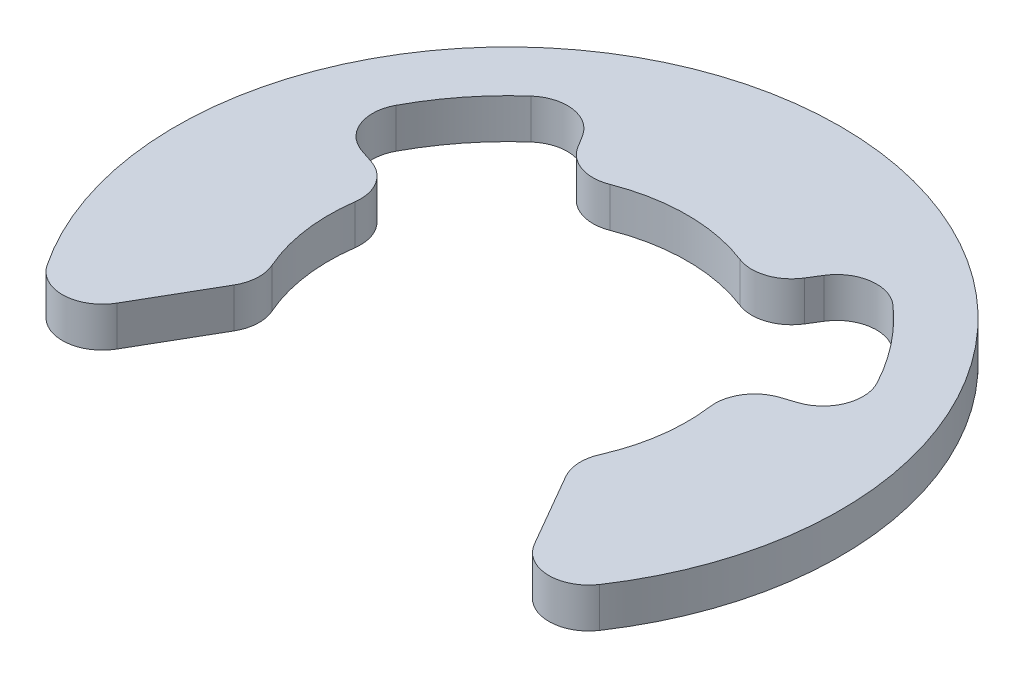
ISO-10303-21;
HEADER;
FILE_DESCRIPTION(('STEP AP214'),'2;1');
FILE_NAME('part.step','',(''),(''),'','','');
FILE_SCHEMA(('AUTOMOTIVE_DESIGN { 1 0 10303 214 1 1 1 1 }'));
ENDSEC;
DATA;
#1=APPLICATION_CONTEXT('core data for automotive mechanical design processes');
#2=APPLICATION_PROTOCOL_DEFINITION('international standard','automotive_design',2000,#1);
#3=PRODUCT_CONTEXT('',#1,'mechanical');
#4=PRODUCT('Part','Part','',(#3));
#5=PRODUCT_RELATED_PRODUCT_CATEGORY('part','',(#4));
#6=PRODUCT_DEFINITION_FORMATION('','',#4);
#7=PRODUCT_DEFINITION_CONTEXT('part definition',#1,'design');
#8=PRODUCT_DEFINITION('design','',#6,#7);
#9=PRODUCT_DEFINITION_SHAPE('','',#8);
#10=(LENGTH_UNIT() NAMED_UNIT(*) SI_UNIT(.MILLI.,.METRE.));
#11=(NAMED_UNIT(*) PLANE_ANGLE_UNIT() SI_UNIT($,.RADIAN.));
#12=(NAMED_UNIT(*) SI_UNIT($,.STERADIAN.) SOLID_ANGLE_UNIT());
#13=UNCERTAINTY_MEASURE_WITH_UNIT(LENGTH_MEASURE(1.E-05),#10,'distance_accuracy_value','');
#14=(GEOMETRIC_REPRESENTATION_CONTEXT(3) GLOBAL_UNCERTAINTY_ASSIGNED_CONTEXT((#13)) GLOBAL_UNIT_ASSIGNED_CONTEXT((#10,
#11,#12)) REPRESENTATION_CONTEXT('',''));
#15=CARTESIAN_POINT('',(0.,0.,0.));
#16=DIRECTION('',(0.,0.,1.));
#17=DIRECTION('',(1.,0.,0.));
#18=AXIS2_PLACEMENT_3D('',#15,#16,#17);
#19=CARTESIAN_POINT('',(0.,-0.5,0.));
#20=DIRECTION('',(0.,1.,0.));
#21=DIRECTION('',(0.,0.,1.));
#22=AXIS2_PLACEMENT_3D('',#19,#20,#21);
#23=PLANE('',#22);
#24=CARTESIAN_POINT('',(-5.03311248096179,-0.5,2.21760653723484));
#25=DIRECTION('',(0.,-1.,0.));
#26=DIRECTION('',(0.,0.,-1.));
#27=AXIS2_PLACEMENT_3D('',#24,#25,#26);
#28=CIRCLE('',#27,1.);
#29=CARTESIAN_POINT('',(-4.16708707717735,-0.5,2.71760653723484));
#30=VERTEX_POINT('',#29);
#31=CARTESIAN_POINT('',(-4.11800112078692,-0.5,1.81440534864669));
#32=VERTEX_POINT('',#31);
#33=EDGE_CURVE('E19',#30,#32,#28,.F.);
#34=ORIENTED_EDGE('',*,*,#33,.F.);
#35=DIRECTION('',(-0.500000000000001,0.,0.866025403784438));
#36=VECTOR('',#35,1.);
#37=CARTESIAN_POINT('',(-3.89711431702998,-0.5,2.24999999999999));
#38=LINE('',#37,#36);
#39=CARTESIAN_POINT('',(-5.2447671032849,-0.5,4.58420309675526));
#40=VERTEX_POINT('',#39);
#41=EDGE_CURVE('E171',#30,#40,#38,.T.);
#42=ORIENTED_EDGE('',*,*,#41,.T.);
#43=CARTESIAN_POINT('',(-6.11079250706933,-0.5,4.08420309675526));
#44=DIRECTION('',(0.,-1.,0.));
#45=DIRECTION('',(0.,0.,-1.));
#46=AXIS2_PLACEMENT_3D('',#43,#44,#45);
#47=CIRCLE('',#46,1.);
#48=CARTESIAN_POINT('',(-6.9421928481672,-0.5,4.63987698747026));
#49=VERTEX_POINT('',#48);
#50=EDGE_CURVE('E272',#49,#40,#47,.F.);
#51=ORIENTED_EDGE('',*,*,#50,.F.);
#52=CARTESIAN_POINT('',(0.,-0.5,0.));
#53=DIRECTION('',(0.,-1.,0.));
#54=DIRECTION('',(0.,0.,-1.));
#55=AXIS2_PLACEMENT_3D('',#52,#53,#54);
#56=CIRCLE('',#55,8.35);
#57=CARTESIAN_POINT('',(6.9421928481672,-0.5,4.63987698747026));
#58=VERTEX_POINT('',#57);
#59=EDGE_CURVE('E277',#58,#49,#56,.F.);
#60=ORIENTED_EDGE('',*,*,#59,.F.);
#61=CARTESIAN_POINT('',(6.11079250706933,-0.5,4.08420309675526));
#62=DIRECTION('',(0.,-1.,0.));
#63=DIRECTION('',(0.,0.,-1.));
#64=AXIS2_PLACEMENT_3D('',#61,#62,#63);
#65=CIRCLE('',#64,1.);
#66=CARTESIAN_POINT('',(5.2447671032849,-0.5,4.58420309675526));
#67=VERTEX_POINT('',#66);
#68=EDGE_CURVE('E280',#67,#58,#65,.F.);
#69=ORIENTED_EDGE('',*,*,#68,.F.);
#70=DIRECTION('',(-0.500000000000001,0.,-0.866025403784438));
#71=VECTOR('',#70,1.);
#72=CARTESIAN_POINT('',(3.89711431702998,-0.5,2.24999999999999));
#73=LINE('',#72,#71);
#74=CARTESIAN_POINT('',(4.16708707717735,-0.5,2.71760653723484));
#75=VERTEX_POINT('',#74);
#76=EDGE_CURVE('E201',#67,#75,#73,.T.);
#77=ORIENTED_EDGE('',*,*,#76,.T.);
#78=CARTESIAN_POINT('',(5.03311248096179,-0.5,2.21760653723484));
#79=DIRECTION('',(0.,-1.,0.));
#80=DIRECTION('',(0.,0.,-1.));
#81=AXIS2_PLACEMENT_3D('',#78,#79,#80);
#82=CIRCLE('',#81,1.);
#83=CARTESIAN_POINT('',(4.11800112078692,-0.5,1.81440534864669));
#84=VERTEX_POINT('',#83);
#85=EDGE_CURVE('E283',#84,#75,#82,.F.);
#86=ORIENTED_EDGE('',*,*,#85,.F.);
#87=CARTESIAN_POINT('',(0.,-0.5,0.));
#88=DIRECTION('',(0.,-1.,0.));
#89=DIRECTION('',(0.,0.,-1.));
#90=AXIS2_PLACEMENT_3D('',#87,#88,#89);
#91=CIRCLE('',#90,4.5);
#92=CARTESIAN_POINT('',(4.45860960941982,-0.5,-0.608933781941234));
#93=VERTEX_POINT('',#92);
#94=EDGE_CURVE('E286',#84,#93,#91,.F.);
#95=ORIENTED_EDGE('',*,*,#94,.T.);
#96=CARTESIAN_POINT('',(5.44941174484645,-0.5,-0.744252400150397));
#97=DIRECTION('',(0.,-1.,0.));
#98=DIRECTION('',(0.,0.,-1.));
#99=AXIS2_PLACEMENT_3D('',#96,#97,#98);
#100=CIRCLE('',#99,1.);
#101=CARTESIAN_POINT('',(5.13620275209304,-0.5,-1.69393662496325));
#102=VERTEX_POINT('',#101);
#103=EDGE_CURVE('E290',#102,#93,#100,.F.);
#104=ORIENTED_EDGE('',*,*,#103,.F.);
#105=DIRECTION('',(0.949684224812857,0.,-0.313208992753406));
#106=VECTOR('',#105,1.);
#107=CARTESIAN_POINT('',(4.27357901165786,-0.5,-1.40944046739033));
#108=LINE('',#107,#106);
#109=CARTESIAN_POINT('',(5.47388134366768,-0.5,-1.80530413932027));
#110=VERTEX_POINT('',#109);
#111=EDGE_CURVE('E206',#102,#110,#108,.T.);
#112=ORIENTED_EDGE('',*,*,#111,.T.);
#113=CARTESIAN_POINT('',(5.16067235091428,-0.5,-2.75498836413313));
#114=DIRECTION('',(0.,-1.,0.));
#115=DIRECTION('',(0.,0.,-1.));
#116=AXIS2_PLACEMENT_3D('',#113,#114,#115);
#117=CIRCLE('',#116,1.);
#118=CARTESIAN_POINT('',(6.04283856474577,-0.5,-3.22592654603623));
#119=VERTEX_POINT('',#118);
#120=EDGE_CURVE('E292',#110,#119,#117,.F.);
#121=ORIENTED_EDGE('',*,*,#120,.T.);
#122=CARTESIAN_POINT('',(0.,-0.5,0.));
#123=DIRECTION('',(0.,-1.,0.));
#124=DIRECTION('',(0.,0.,-1.));
#125=AXIS2_PLACEMENT_3D('',#122,#123,#124);
#126=CIRCLE('',#125,6.85);
#127=CARTESIAN_POINT('',(4.54697908095998,-0.5,-5.123229571014));
#128=VERTEX_POINT('',#127);
#129=EDGE_CURVE('E295',#119,#128,#126,.F.);
#130=ORIENTED_EDGE('',*,*,#129,.T.);
#131=CARTESIAN_POINT('',(3.88318651439648,-0.5,-4.37531284531853));
#132=DIRECTION('',(0.,-1.,0.));
#133=DIRECTION('',(0.,0.,-1.));
#134=AXIS2_PLACEMENT_3D('',#131,#132,#133);
#135=CIRCLE('',#134,1.);
#136=CARTESIAN_POINT('',(3.03280925313837,-0.5,-4.90148630866988));
#137=VERTEX_POINT('',#136);
#138=EDGE_CURVE('E299',#128,#137,#135,.F.);
#139=ORIENTED_EDGE('',*,*,#138,.T.);
#140=DIRECTION('',(-0.526173463351351,0.,0.85037726125811));
#141=VECTOR('',#140,1.);
#142=CARTESIAN_POINT('',(2.36778058508108,-0.5,-3.8266976756615));
#143=LINE('',#142,#141);
#144=CARTESIAN_POINT('',(2.84571810285265,-0.5,-4.59911822843213));
#145=VERTEX_POINT('',#144);
#146=EDGE_CURVE('E211',#137,#145,#143,.T.);
#147=ORIENTED_EDGE('',*,*,#146,.T.);
#148=CARTESIAN_POINT('',(1.99534084159454,-0.5,-5.12529169178348));
#149=DIRECTION('',(0.,-1.,0.));
#150=DIRECTION('',(0.,0.,-1.));
#151=AXIS2_PLACEMENT_3D('',#148,#149,#150);
#152=CIRCLE('',#151,1.);
#153=CARTESIAN_POINT('',(1.63255159766826,-0.5,-4.19342047509558));
#154=VERTEX_POINT('',#153);
#155=EDGE_CURVE('E301',#154,#145,#152,.F.);
#156=ORIENTED_EDGE('',*,*,#155,.F.);
#157=CARTESIAN_POINT('',(0.,-0.5,0.));
#158=DIRECTION('',(0.,-1.,0.));
#159=DIRECTION('',(0.,0.,-1.));
#160=AXIS2_PLACEMENT_3D('',#157,#158,#159);
#161=CIRCLE('',#160,4.5);
#162=CARTESIAN_POINT('',(-1.63255159766826,-0.5,-4.19342047509558));
#163=VERTEX_POINT('',#162);
#164=EDGE_CURVE('E304',#154,#163,#161,.F.);
#165=ORIENTED_EDGE('',*,*,#164,.T.);
#166=CARTESIAN_POINT('',(-1.99534084159454,-0.5,-5.12529169178348));
#167=DIRECTION('',(0.,-1.,0.));
#168=DIRECTION('',(0.,0.,-1.));
#169=AXIS2_PLACEMENT_3D('',#166,#167,#168);
#170=CIRCLE('',#169,1.);
#171=CARTESIAN_POINT('',(-2.84571810285265,-0.5,-4.59911822843213));
#172=VERTEX_POINT('',#171);
#173=EDGE_CURVE('E307',#172,#163,#170,.F.);
#174=ORIENTED_EDGE('',*,*,#173,.F.);
#175=DIRECTION('',(-0.526173463351351,0.,-0.85037726125811));
#176=VECTOR('',#175,1.);
#177=CARTESIAN_POINT('',(-2.36778058508108,-0.5,-3.8266976756615));
#178=LINE('',#177,#176);
#179=CARTESIAN_POINT('',(-3.03280925313837,-0.5,-4.90148630866988));
#180=VERTEX_POINT('',#179);
#181=EDGE_CURVE('E216',#172,#180,#178,.T.);
#182=ORIENTED_EDGE('',*,*,#181,.T.);
#183=CARTESIAN_POINT('',(-3.88318651439648,-0.5,-4.37531284531853));
#184=DIRECTION('',(0.,-1.,0.));
#185=DIRECTION('',(0.,0.,-1.));
#186=AXIS2_PLACEMENT_3D('',#183,#184,#185);
#187=CIRCLE('',#186,1.);
#188=CARTESIAN_POINT('',(-4.54697908095998,-0.5,-5.123229571014));
#189=VERTEX_POINT('',#188);
#190=EDGE_CURVE('E310',#180,#189,#187,.F.);
#191=ORIENTED_EDGE('',*,*,#190,.T.);
#192=CARTESIAN_POINT('',(0.,-0.5,0.));
#193=DIRECTION('',(0.,-1.,0.));
#194=DIRECTION('',(0.,0.,-1.));
#195=AXIS2_PLACEMENT_3D('',#192,#193,#194);
#196=CIRCLE('',#195,6.85);
#197=CARTESIAN_POINT('',(-6.04283856474578,-0.5,-3.22592654603623));
#198=VERTEX_POINT('',#197);
#199=EDGE_CURVE('E313',#189,#198,#196,.F.);
#200=ORIENTED_EDGE('',*,*,#199,.T.);
#201=CARTESIAN_POINT('',(-5.16067235091428,-0.5,-2.75498836413313));
#202=DIRECTION('',(0.,-1.,0.));
#203=DIRECTION('',(0.,0.,-1.));
#204=AXIS2_PLACEMENT_3D('',#201,#202,#203);
#205=CIRCLE('',#204,1.);
#206=CARTESIAN_POINT('',(-5.47388134366768,-0.5,-1.80530413932027));
#207=VERTEX_POINT('',#206);
#208=EDGE_CURVE('E317',#198,#207,#205,.F.);
#209=ORIENTED_EDGE('',*,*,#208,.T.);
#210=DIRECTION('',(0.949684224812857,0.,0.313208992753406));
#211=VECTOR('',#210,1.);
#212=CARTESIAN_POINT('',(-4.27357901165786,-0.5,-1.40944046739033));
#213=LINE('',#212,#211);
#214=CARTESIAN_POINT('',(-5.13620275209304,-0.5,-1.69393662496325));
#215=VERTEX_POINT('',#214);
#216=EDGE_CURVE('E221',#207,#215,#213,.T.);
#217=ORIENTED_EDGE('',*,*,#216,.T.);
#218=CARTESIAN_POINT('',(-5.44941174484645,-0.5,-0.744252400150397));
#219=DIRECTION('',(0.,-1.,0.));
#220=DIRECTION('',(0.,0.,-1.));
#221=AXIS2_PLACEMENT_3D('',#218,#219,#220);
#222=CIRCLE('',#221,1.);
#223=CARTESIAN_POINT('',(-4.45860960941982,-0.5,-0.608933781941234));
#224=VERTEX_POINT('',#223);
#225=EDGE_CURVE('E180',#224,#215,#222,.F.);
#226=ORIENTED_EDGE('',*,*,#225,.F.);
#227=CARTESIAN_POINT('',(0.,-0.5,0.));
#228=DIRECTION('',(0.,-1.,0.));
#229=DIRECTION('',(0.,0.,-1.));
#230=AXIS2_PLACEMENT_3D('',#227,#228,#229);
#231=CIRCLE('',#230,4.5);
#232=EDGE_CURVE('E176',#224,#32,#231,.F.);
#233=ORIENTED_EDGE('',*,*,#232,.T.);
#234=EDGE_LOOP('',(#34,#42,#51,#60,#69,#77,#86,#95,#104,#112,#121,#130,#139,#147,#156,#165,#174,
#182,#191,#200,#209,#217,#226,#233));
#235=FACE_BOUND('',#234,.T.);
#236=ADVANCED_FACE('F16',(#235),#23,.F.);
#237=CARTESIAN_POINT('',(-3.89711431702998,0.5,2.24999999999999));
#238=DIRECTION('',(-0.866025403784438,0.,-0.500000000000001));
#239=DIRECTION('',(-0.500000000000001,0.,0.866025403784438));
#240=AXIS2_PLACEMENT_3D('',#237,#238,#239);
#241=PLANE('',#240);
#242=DIRECTION('',(0.,-1.,0.));
#243=VECTOR('',#242,1.);
#244=CARTESIAN_POINT('',(-4.16708707717735,0.5,2.71760653723484));
#245=LINE('',#244,#243);
#246=CARTESIAN_POINT('',(-4.16708707717735,0.5,2.71760653723484));
#247=VERTEX_POINT('',#246);
#248=EDGE_CURVE('E189',#247,#30,#245,.T.);
#249=ORIENTED_EDGE('',*,*,#248,.F.);
#250=DIRECTION('',(0.500000000000001,0.,-0.866025403784438));
#251=VECTOR('',#250,1.);
#252=CARTESIAN_POINT('',(-5.2447671032849,0.5,4.58420309675526));
#253=LINE('',#252,#251);
#254=CARTESIAN_POINT('',(-5.2447671032849,0.5,4.58420309675526));
#255=VERTEX_POINT('',#254);
#256=EDGE_CURVE('E271',#255,#247,#253,.T.);
#257=ORIENTED_EDGE('',*,*,#256,.F.);
#258=DIRECTION('',(0.,-1.,0.));
#259=VECTOR('',#258,1.);
#260=CARTESIAN_POINT('',(-5.2447671032849,0.5,4.58420309675526));
#261=LINE('',#260,#259);
#262=EDGE_CURVE('E275',#40,#255,#261,.F.);
#263=ORIENTED_EDGE('',*,*,#262,.F.);
#264=ORIENTED_EDGE('',*,*,#41,.F.);
#265=EDGE_LOOP('',(#249,#257,#263,#264));
#266=FACE_BOUND('',#265,.T.);
#267=ADVANCED_FACE('F387',(#266),#241,.F.);
#268=CARTESIAN_POINT('',(-5.03311248096179,0.5,2.21760653723484));
#269=DIRECTION('',(0.,-1.,0.));
#270=DIRECTION('',(0.,0.,-1.));
#271=AXIS2_PLACEMENT_3D('',#268,#269,#270);
#272=CYLINDRICAL_SURFACE('',#271,1.);
#273=ORIENTED_EDGE('',*,*,#33,.T.);
#274=DIRECTION('',(0.,-1.,0.));
#275=VECTOR('',#274,1.);
#276=CARTESIAN_POINT('',(-4.11800112078692,0.5,1.81440534864669));
#277=LINE('',#276,#275);
#278=CARTESIAN_POINT('',(-4.11800112078692,0.5,1.81440534864669));
#279=VERTEX_POINT('',#278);
#280=EDGE_CURVE('E184',#32,#279,#277,.F.);
#281=ORIENTED_EDGE('',*,*,#280,.T.);
#282=CARTESIAN_POINT('',(-5.03311248096179,0.5,2.21760653723484));
#283=DIRECTION('',(0.,-1.,0.));
#284=DIRECTION('',(0.,0.,-1.));
#285=AXIS2_PLACEMENT_3D('',#282,#283,#284);
#286=CIRCLE('',#285,1.);
#287=EDGE_CURVE('E269',#247,#279,#286,.F.);
#288=ORIENTED_EDGE('',*,*,#287,.F.);
#289=ORIENTED_EDGE('',*,*,#248,.T.);
#290=EDGE_LOOP('',(#273,#281,#288,#289));
#291=FACE_BOUND('',#290,.T.);
#292=ADVANCED_FACE('F186',(#291),#272,.T.);
#293=CARTESIAN_POINT('',(0.,0.5,0.));
#294=DIRECTION('',(0.,-1.,0.));
#295=DIRECTION('',(0.,0.,-1.));
#296=AXIS2_PLACEMENT_3D('',#293,#294,#295);
#297=CYLINDRICAL_SURFACE('',#296,4.5);
#298=ORIENTED_EDGE('',*,*,#280,.F.);
#299=ORIENTED_EDGE('',*,*,#232,.F.);
#300=DIRECTION('',(0.,-1.,0.));
#301=VECTOR('',#300,1.);
#302=CARTESIAN_POINT('',(-4.45860960941982,0.5,-0.608933781941234));
#303=LINE('',#302,#301);
#304=CARTESIAN_POINT('',(-4.45860960941982,0.5,-0.608933781941234));
#305=VERTEX_POINT('',#304);
#306=EDGE_CURVE('E194',#305,#224,#303,.T.);
#307=ORIENTED_EDGE('',*,*,#306,.F.);
#308=CARTESIAN_POINT('',(0.,0.5,0.));
#309=DIRECTION('',(0.,-1.,0.));
#310=DIRECTION('',(0.,0.,-1.));
#311=AXIS2_PLACEMENT_3D('',#308,#309,#310);
#312=CIRCLE('',#311,4.5);
#313=EDGE_CURVE('E192',#279,#305,#312,.T.);
#314=ORIENTED_EDGE('',*,*,#313,.F.);
#315=EDGE_LOOP('',(#298,#299,#307,#314));
#316=FACE_BOUND('',#315,.T.);
#317=ADVANCED_FACE('F190',(#316),#297,.F.);
#318=CARTESIAN_POINT('',(-5.44941174484645,0.5,-0.744252400150397));
#319=DIRECTION('',(0.,-1.,0.));
#320=DIRECTION('',(0.,0.,-1.));
#321=AXIS2_PLACEMENT_3D('',#318,#319,#320);
#322=CYLINDRICAL_SURFACE('',#321,1.);
#323=ORIENTED_EDGE('',*,*,#225,.T.);
#324=DIRECTION('',(0.,1.,0.));
#325=VECTOR('',#324,1.);
#326=CARTESIAN_POINT('',(-5.13620275209304,0.5,-1.69393662496325));
#327=LINE('',#326,#325);
#328=CARTESIAN_POINT('',(-5.13620275209304,0.5,-1.69393662496325));
#329=VERTEX_POINT('',#328);
#330=EDGE_CURVE('E222',#215,#329,#327,.T.);
#331=ORIENTED_EDGE('',*,*,#330,.T.);
#332=CARTESIAN_POINT('',(-5.44941174484645,0.5,-0.744252400150397));
#333=DIRECTION('',(0.,-1.,0.));
#334=DIRECTION('',(0.,0.,-1.));
#335=AXIS2_PLACEMENT_3D('',#332,#333,#334);
#336=CIRCLE('',#335,1.);
#337=EDGE_CURVE('E265',#305,#329,#336,.F.);
#338=ORIENTED_EDGE('',*,*,#337,.F.);
#339=ORIENTED_EDGE('',*,*,#306,.T.);
#340=EDGE_LOOP('',(#323,#331,#338,#339));
#341=FACE_BOUND('',#340,.T.);
#342=ADVANCED_FACE('F321',(#341),#322,.T.);
#343=CARTESIAN_POINT('',(-4.27357901165786,0.5,-1.40944046739033));
#344=DIRECTION('',(-0.313208992753406,0.,0.949684224812857));
#345=DIRECTION('',(0.949684224812857,0.,0.313208992753406));
#346=AXIS2_PLACEMENT_3D('',#343,#344,#345);
#347=PLANE('',#346);
#348=ORIENTED_EDGE('',*,*,#330,.F.);
#349=ORIENTED_EDGE('',*,*,#216,.F.);
#350=DIRECTION('',(0.,-1.,0.));
#351=VECTOR('',#350,1.);
#352=CARTESIAN_POINT('',(-5.47388134366768,0.5,-1.80530413932027));
#353=LINE('',#352,#351);
#354=CARTESIAN_POINT('',(-5.47388134366768,0.5,-1.80530413932027));
#355=VERTEX_POINT('',#354);
#356=EDGE_CURVE('E316',#207,#355,#353,.F.);
#357=ORIENTED_EDGE('',*,*,#356,.T.);
#358=DIRECTION('',(-0.949684224812857,0.,-0.313208992753405));
#359=VECTOR('',#358,1.);
#360=CARTESIAN_POINT('',(-5.13620275209304,0.5,-1.69393662496325));
#361=LINE('',#360,#359);
#362=EDGE_CURVE('E264',#329,#355,#361,.T.);
#363=ORIENTED_EDGE('',*,*,#362,.F.);
#364=EDGE_LOOP('',(#348,#349,#357,#363));
#365=FACE_BOUND('',#364,.T.);
#366=ADVANCED_FACE('F326',(#365),#347,.F.);
#367=CARTESIAN_POINT('',(-5.16067235091428,0.5,-2.75498836413313));
#368=DIRECTION('',(0.,-1.,0.));
#369=DIRECTION('',(0.,0.,-1.));
#370=AXIS2_PLACEMENT_3D('',#367,#368,#369);
#371=CYLINDRICAL_SURFACE('',#370,1.);
#372=ORIENTED_EDGE('',*,*,#356,.F.);
#373=ORIENTED_EDGE('',*,*,#208,.F.);
#374=DIRECTION('',(0.,-1.,0.));
#375=VECTOR('',#374,1.);
#376=CARTESIAN_POINT('',(-6.04283856474578,0.5,-3.22592654603623));
#377=LINE('',#376,#375);
#378=CARTESIAN_POINT('',(-6.04283856474578,0.5,-3.22592654603623));
#379=VERTEX_POINT('',#378);
#380=EDGE_CURVE('E315',#198,#379,#377,.F.);
#381=ORIENTED_EDGE('',*,*,#380,.T.);
#382=CARTESIAN_POINT('',(-5.16067235091428,0.5,-2.75498836413313));
#383=DIRECTION('',(0.,-1.,0.));
#384=DIRECTION('',(0.,0.,-1.));
#385=AXIS2_PLACEMENT_3D('',#382,#383,#384);
#386=CIRCLE('',#385,1.);
#387=EDGE_CURVE('E261',#355,#379,#386,.T.);
#388=ORIENTED_EDGE('',*,*,#387,.F.);
#389=EDGE_LOOP('',(#372,#373,#381,#388));
#390=FACE_BOUND('',#389,.T.);
#391=ADVANCED_FACE('F391',(#390),#371,.F.);
#392=CARTESIAN_POINT('',(0.,0.5,0.));
#393=DIRECTION('',(0.,-1.,0.));
#394=DIRECTION('',(0.,0.,-1.));
#395=AXIS2_PLACEMENT_3D('',#392,#393,#394);
#396=CYLINDRICAL_SURFACE('',#395,6.85);
#397=ORIENTED_EDGE('',*,*,#380,.F.);
#398=ORIENTED_EDGE('',*,*,#199,.F.);
#399=DIRECTION('',(0.,-1.,0.));
#400=VECTOR('',#399,1.);
#401=CARTESIAN_POINT('',(-4.54697908095998,0.5,-5.123229571014));
#402=LINE('',#401,#400);
#403=CARTESIAN_POINT('',(-4.54697908095998,0.5,-5.123229571014));
#404=VERTEX_POINT('',#403);
#405=EDGE_CURVE('E312',#189,#404,#402,.F.);
#406=ORIENTED_EDGE('',*,*,#405,.T.);
#407=CARTESIAN_POINT('',(0.,0.5,0.));
#408=DIRECTION('',(0.,-1.,0.));
#409=DIRECTION('',(0.,0.,-1.));
#410=AXIS2_PLACEMENT_3D('',#407,#408,#409);
#411=CIRCLE('',#410,6.85);
#412=EDGE_CURVE('E258',#379,#404,#411,.T.);
#413=ORIENTED_EDGE('',*,*,#412,.F.);
#414=EDGE_LOOP('',(#397,#398,#406,#413));
#415=FACE_BOUND('',#414,.T.);
#416=ADVANCED_FACE('F396',(#415),#396,.F.);
#417=CARTESIAN_POINT('',(-3.88318651439648,0.5,-4.37531284531853));
#418=DIRECTION('',(0.,-1.,0.));
#419=DIRECTION('',(0.,0.,-1.));
#420=AXIS2_PLACEMENT_3D('',#417,#418,#419);
#421=CYLINDRICAL_SURFACE('',#420,1.);
#422=DIRECTION('',(0.,1.,0.));
#423=VECTOR('',#422,1.);
#424=CARTESIAN_POINT('',(-3.03280925313837,0.5,-4.90148630866988));
#425=LINE('',#424,#423);
#426=CARTESIAN_POINT('',(-3.03280925313837,0.5,-4.90148630866988));
#427=VERTEX_POINT('',#426);
#428=EDGE_CURVE('E220',#180,#427,#425,.T.);
#429=ORIENTED_EDGE('',*,*,#428,.T.);
#430=CARTESIAN_POINT('',(-3.88318651439648,0.5,-4.37531284531853));
#431=DIRECTION('',(0.,-1.,0.));
#432=DIRECTION('',(0.,0.,-1.));
#433=AXIS2_PLACEMENT_3D('',#430,#431,#432);
#434=CIRCLE('',#433,1.);
#435=EDGE_CURVE('E256',#404,#427,#434,.T.);
#436=ORIENTED_EDGE('',*,*,#435,.F.);
#437=ORIENTED_EDGE('',*,*,#405,.F.);
#438=ORIENTED_EDGE('',*,*,#190,.F.);
#439=EDGE_LOOP('',(#429,#436,#437,#438));
#440=FACE_BOUND('',#439,.T.);
#441=ADVANCED_FACE('F400',(#440),#421,.F.);
#442=CARTESIAN_POINT('',(-2.36778058508108,0.5,-3.8266976756615));
#443=DIRECTION('',(0.85037726125811,0.,-0.526173463351351));
#444=DIRECTION('',(-0.526173463351351,0.,-0.85037726125811));
#445=AXIS2_PLACEMENT_3D('',#442,#443,#444);
#446=PLANE('',#445);
#447=DIRECTION('',(0.,-1.,0.));
#448=VECTOR('',#447,1.);
#449=CARTESIAN_POINT('',(-2.84571810285265,0.5,-4.59911822843213));
#450=LINE('',#449,#448);
#451=CARTESIAN_POINT('',(-2.84571810285265,0.5,-4.59911822843213));
#452=VERTEX_POINT('',#451);
#453=EDGE_CURVE('E219',#452,#172,#450,.T.);
#454=ORIENTED_EDGE('',*,*,#453,.F.);
#455=DIRECTION('',(0.526173463351352,0.,0.85037726125811));
#456=VECTOR('',#455,1.);
#457=CARTESIAN_POINT('',(-3.03280925313837,0.5,-4.90148630866988));
#458=LINE('',#457,#456);
#459=EDGE_CURVE('E255',#427,#452,#458,.T.);
#460=ORIENTED_EDGE('',*,*,#459,.F.);
#461=ORIENTED_EDGE('',*,*,#428,.F.);
#462=ORIENTED_EDGE('',*,*,#181,.F.);
#463=EDGE_LOOP('',(#454,#460,#461,#462));
#464=FACE_BOUND('',#463,.T.);
#465=ADVANCED_FACE('F405',(#464),#446,.F.);
#466=CARTESIAN_POINT('',(-1.99534084159454,0.5,-5.12529169178348));
#467=DIRECTION('',(0.,-1.,0.));
#468=DIRECTION('',(0.,0.,-1.));
#469=AXIS2_PLACEMENT_3D('',#466,#467,#468);
#470=CYLINDRICAL_SURFACE('',#469,1.);
#471=ORIENTED_EDGE('',*,*,#173,.T.);
#472=DIRECTION('',(0.,-1.,0.));
#473=VECTOR('',#472,1.);
#474=CARTESIAN_POINT('',(-1.63255159766826,0.5,-4.19342047509558));
#475=LINE('',#474,#473);
#476=CARTESIAN_POINT('',(-1.63255159766826,0.5,-4.19342047509558));
#477=VERTEX_POINT('',#476);
#478=EDGE_CURVE('E306',#163,#477,#475,.F.);
#479=ORIENTED_EDGE('',*,*,#478,.T.);
#480=CARTESIAN_POINT('',(-1.99534084159454,0.5,-5.12529169178348));
#481=DIRECTION('',(0.,-1.,0.));
#482=DIRECTION('',(0.,0.,-1.));
#483=AXIS2_PLACEMENT_3D('',#480,#481,#482);
#484=CIRCLE('',#483,1.);
#485=EDGE_CURVE('E252',#452,#477,#484,.F.);
#486=ORIENTED_EDGE('',*,*,#485,.F.);
#487=ORIENTED_EDGE('',*,*,#453,.T.);
#488=EDGE_LOOP('',(#471,#479,#486,#487));
#489=FACE_BOUND('',#488,.T.);
#490=ADVANCED_FACE('F408',(#489),#470,.T.);
#491=CARTESIAN_POINT('',(0.,0.5,0.));
#492=DIRECTION('',(0.,-1.,0.));
#493=DIRECTION('',(0.,0.,-1.));
#494=AXIS2_PLACEMENT_3D('',#491,#492,#493);
#495=CYLINDRICAL_SURFACE('',#494,4.5);
#496=DIRECTION('',(0.,-1.,0.));
#497=VECTOR('',#496,1.);
#498=CARTESIAN_POINT('',(1.63255159766826,0.5,-4.19342047509558));
#499=LINE('',#498,#497);
#500=CARTESIAN_POINT('',(1.63255159766826,0.5,-4.19342047509558));
#501=VERTEX_POINT('',#500);
#502=EDGE_CURVE('E303',#501,#154,#499,.T.);
#503=ORIENTED_EDGE('',*,*,#502,.F.);
#504=CARTESIAN_POINT('',(0.,0.5,0.));
#505=DIRECTION('',(0.,-1.,0.));
#506=DIRECTION('',(0.,0.,-1.));
#507=AXIS2_PLACEMENT_3D('',#504,#505,#506);
#508=CIRCLE('',#507,4.5);
#509=EDGE_CURVE('E250',#477,#501,#508,.T.);
#510=ORIENTED_EDGE('',*,*,#509,.F.);
#511=ORIENTED_EDGE('',*,*,#478,.F.);
#512=ORIENTED_EDGE('',*,*,#164,.F.);
#513=EDGE_LOOP('',(#503,#510,#511,#512));
#514=FACE_BOUND('',#513,.T.);
#515=ADVANCED_FACE('F413',(#514),#495,.F.);
#516=CARTESIAN_POINT('',(1.99534084159454,0.5,-5.12529169178348));
#517=DIRECTION('',(0.,-1.,0.));
#518=DIRECTION('',(0.,0.,-1.));
#519=AXIS2_PLACEMENT_3D('',#516,#517,#518);
#520=CYLINDRICAL_SURFACE('',#519,1.);
#521=ORIENTED_EDGE('',*,*,#155,.T.);
#522=DIRECTION('',(0.,1.,0.));
#523=VECTOR('',#522,1.);
#524=CARTESIAN_POINT('',(2.84571810285265,0.5,-4.59911822843213));
#525=LINE('',#524,#523);
#526=CARTESIAN_POINT('',(2.84571810285265,0.5,-4.59911822843213));
#527=VERTEX_POINT('',#526);
#528=EDGE_CURVE('E215',#145,#527,#525,.T.);
#529=ORIENTED_EDGE('',*,*,#528,.T.);
#530=CARTESIAN_POINT('',(1.99534084159454,0.5,-5.12529169178348));
#531=DIRECTION('',(0.,-1.,0.));
#532=DIRECTION('',(0.,0.,-1.));
#533=AXIS2_PLACEMENT_3D('',#530,#531,#532);
#534=CIRCLE('',#533,1.);
#535=EDGE_CURVE('E247',#501,#527,#534,.F.);
#536=ORIENTED_EDGE('',*,*,#535,.F.);
#537=ORIENTED_EDGE('',*,*,#502,.T.);
#538=EDGE_LOOP('',(#521,#529,#536,#537));
#539=FACE_BOUND('',#538,.T.);
#540=ADVANCED_FACE('F417',(#539),#520,.T.);
#541=CARTESIAN_POINT('',(2.36778058508108,0.5,-3.8266976756615));
#542=DIRECTION('',(-0.85037726125811,0.,-0.526173463351351));
#543=DIRECTION('',(-0.526173463351351,0.,0.85037726125811));
#544=AXIS2_PLACEMENT_3D('',#541,#542,#543);
#545=PLANE('',#544);
#546=DIRECTION('',(0.,-1.,0.));
#547=VECTOR('',#546,1.);
#548=CARTESIAN_POINT('',(3.03280925313837,0.5,-4.90148630866988));
#549=LINE('',#548,#547);
#550=CARTESIAN_POINT('',(3.03280925313837,0.5,-4.90148630866988));
#551=VERTEX_POINT('',#550);
#552=EDGE_CURVE('E214',#137,#551,#549,.F.);
#553=ORIENTED_EDGE('',*,*,#552,.T.);
#554=DIRECTION('',(0.526173463351352,0.,-0.85037726125811));
#555=VECTOR('',#554,1.);
#556=CARTESIAN_POINT('',(2.84571810285265,0.5,-4.59911822843213));
#557=LINE('',#556,#555);
#558=EDGE_CURVE('E246',#527,#551,#557,.T.);
#559=ORIENTED_EDGE('',*,*,#558,.F.);
#560=ORIENTED_EDGE('',*,*,#528,.F.);
#561=ORIENTED_EDGE('',*,*,#146,.F.);
#562=EDGE_LOOP('',(#553,#559,#560,#561));
#563=FACE_BOUND('',#562,.T.);
#564=ADVANCED_FACE('F422',(#563),#545,.F.);
#565=CARTESIAN_POINT('',(3.88318651439648,0.5,-4.37531284531853));
#566=DIRECTION('',(0.,-1.,0.));
#567=DIRECTION('',(0.,0.,-1.));
#568=AXIS2_PLACEMENT_3D('',#565,#566,#567);
#569=CYLINDRICAL_SURFACE('',#568,1.);
#570=DIRECTION('',(0.,-1.,0.));
#571=VECTOR('',#570,1.);
#572=CARTESIAN_POINT('',(4.54697908095998,0.5,-5.12322957101401));
#573=LINE('',#572,#571);
#574=CARTESIAN_POINT('',(4.54697908095998,0.5,-5.12322957101401));
#575=VERTEX_POINT('',#574);
#576=EDGE_CURVE('E298',#128,#575,#573,.F.);
#577=ORIENTED_EDGE('',*,*,#576,.T.);
#578=CARTESIAN_POINT('',(3.88318651439648,0.5,-4.37531284531853));
#579=DIRECTION('',(0.,-1.,0.));
#580=DIRECTION('',(0.,0.,-1.));
#581=AXIS2_PLACEMENT_3D('',#578,#579,#580);
#582=CIRCLE('',#581,1.);
#583=EDGE_CURVE('E244',#551,#575,#582,.T.);
#584=ORIENTED_EDGE('',*,*,#583,.F.);
#585=ORIENTED_EDGE('',*,*,#552,.F.);
#586=ORIENTED_EDGE('',*,*,#138,.F.);
#587=EDGE_LOOP('',(#577,#584,#585,#586));
#588=FACE_BOUND('',#587,.T.);
#589=ADVANCED_FACE('F426',(#588),#569,.F.);
#590=CARTESIAN_POINT('',(0.,0.5,0.));
#591=DIRECTION('',(0.,-1.,0.));
#592=DIRECTION('',(0.,0.,-1.));
#593=AXIS2_PLACEMENT_3D('',#590,#591,#592);
#594=CYLINDRICAL_SURFACE('',#593,6.85);
#595=DIRECTION('',(0.,-1.,0.));
#596=VECTOR('',#595,1.);
#597=CARTESIAN_POINT('',(6.04283856474577,0.5,-3.22592654603623));
#598=LINE('',#597,#596);
#599=CARTESIAN_POINT('',(6.04283856474577,0.5,-3.22592654603623));
#600=VERTEX_POINT('',#599);
#601=EDGE_CURVE('E294',#119,#600,#598,.F.);
#602=ORIENTED_EDGE('',*,*,#601,.T.);
#603=CARTESIAN_POINT('',(0.,0.5,0.));
#604=DIRECTION('',(0.,-1.,0.));
#605=DIRECTION('',(0.,0.,-1.));
#606=AXIS2_PLACEMENT_3D('',#603,#604,#605);
#607=CIRCLE('',#606,6.85);
#608=EDGE_CURVE('E241',#575,#600,#607,.T.);
#609=ORIENTED_EDGE('',*,*,#608,.F.);
#610=ORIENTED_EDGE('',*,*,#576,.F.);
#611=ORIENTED_EDGE('',*,*,#129,.F.);
#612=EDGE_LOOP('',(#602,#609,#610,#611));
#613=FACE_BOUND('',#612,.T.);
#614=ADVANCED_FACE('F431',(#613),#594,.F.);
#615=CARTESIAN_POINT('',(5.16067235091428,0.5,-2.75498836413313));
#616=DIRECTION('',(0.,-1.,0.));
#617=DIRECTION('',(0.,0.,-1.));
#618=AXIS2_PLACEMENT_3D('',#615,#616,#617);
#619=CYLINDRICAL_SURFACE('',#618,1.);
#620=ORIENTED_EDGE('',*,*,#601,.F.);
#621=ORIENTED_EDGE('',*,*,#120,.F.);
#622=DIRECTION('',(0.,1.,0.));
#623=VECTOR('',#622,1.);
#624=CARTESIAN_POINT('',(5.47388134366768,0.5,-1.80530413932027));
#625=LINE('',#624,#623);
#626=CARTESIAN_POINT('',(5.47388134366768,0.5,-1.80530413932027));
#627=VERTEX_POINT('',#626);
#628=EDGE_CURVE('E210',#110,#627,#625,.T.);
#629=ORIENTED_EDGE('',*,*,#628,.T.);
#630=CARTESIAN_POINT('',(5.16067235091428,0.5,-2.75498836413313));
#631=DIRECTION('',(0.,-1.,0.));
#632=DIRECTION('',(0.,0.,-1.));
#633=AXIS2_PLACEMENT_3D('',#630,#631,#632);
#634=CIRCLE('',#633,1.);
#635=EDGE_CURVE('E238',#600,#627,#634,.T.);
#636=ORIENTED_EDGE('',*,*,#635,.F.);
#637=EDGE_LOOP('',(#620,#621,#629,#636));
#638=FACE_BOUND('',#637,.T.);
#639=ADVANCED_FACE('F435',(#638),#619,.F.);
#640=CARTESIAN_POINT('',(4.27357901165786,0.5,-1.40944046739033));
#641=DIRECTION('',(0.313208992753406,0.,0.949684224812857));
#642=DIRECTION('',(0.949684224812857,0.,-0.313208992753406));
#643=AXIS2_PLACEMENT_3D('',#640,#641,#642);
#644=PLANE('',#643);
#645=DIRECTION('',(0.,-1.,0.));
#646=VECTOR('',#645,1.);
#647=CARTESIAN_POINT('',(5.13620275209304,0.5,-1.69393662496325));
#648=LINE('',#647,#646);
#649=CARTESIAN_POINT('',(5.13620275209304,0.5,-1.69393662496325));
#650=VERTEX_POINT('',#649);
#651=EDGE_CURVE('E209',#650,#102,#648,.T.);
#652=ORIENTED_EDGE('',*,*,#651,.F.);
#653=DIRECTION('',(-0.949684224812857,0.,0.313208992753405));
#654=VECTOR('',#653,1.);
#655=CARTESIAN_POINT('',(5.47388134366768,0.5,-1.80530413932027));
#656=LINE('',#655,#654);
#657=EDGE_CURVE('E237',#627,#650,#656,.T.);
#658=ORIENTED_EDGE('',*,*,#657,.F.);
#659=ORIENTED_EDGE('',*,*,#628,.F.);
#660=ORIENTED_EDGE('',*,*,#111,.F.);
#661=EDGE_LOOP('',(#652,#658,#659,#660));
#662=FACE_BOUND('',#661,.T.);
#663=ADVANCED_FACE('F439',(#662),#644,.F.);
#664=CARTESIAN_POINT('',(5.44941174484645,0.5,-0.744252400150397));
#665=DIRECTION('',(0.,-1.,0.));
#666=DIRECTION('',(0.,0.,-1.));
#667=AXIS2_PLACEMENT_3D('',#664,#665,#666);
#668=CYLINDRICAL_SURFACE('',#667,1.);
#669=ORIENTED_EDGE('',*,*,#103,.T.);
#670=DIRECTION('',(0.,-1.,0.));
#671=VECTOR('',#670,1.);
#672=CARTESIAN_POINT('',(4.45860960941982,0.5,-0.608933781941234));
#673=LINE('',#672,#671);
#674=CARTESIAN_POINT('',(4.45860960941982,0.5,-0.608933781941234));
#675=VERTEX_POINT('',#674);
#676=EDGE_CURVE('E289',#93,#675,#673,.F.);
#677=ORIENTED_EDGE('',*,*,#676,.T.);
#678=CARTESIAN_POINT('',(5.44941174484645,0.5,-0.744252400150397));
#679=DIRECTION('',(0.,-1.,0.));
#680=DIRECTION('',(0.,0.,-1.));
#681=AXIS2_PLACEMENT_3D('',#678,#679,#680);
#682=CIRCLE('',#681,1.);
#683=EDGE_CURVE('E234',#650,#675,#682,.F.);
#684=ORIENTED_EDGE('',*,*,#683,.F.);
#685=ORIENTED_EDGE('',*,*,#651,.T.);
#686=EDGE_LOOP('',(#669,#677,#684,#685));
#687=FACE_BOUND('',#686,.T.);
#688=ADVANCED_FACE('F443',(#687),#668,.T.);
#689=CARTESIAN_POINT('',(0.,0.5,0.));
#690=DIRECTION('',(0.,-1.,0.));
#691=DIRECTION('',(0.,0.,-1.));
#692=AXIS2_PLACEMENT_3D('',#689,#690,#691);
#693=CYLINDRICAL_SURFACE('',#692,4.5);
#694=DIRECTION('',(0.,-1.,0.));
#695=VECTOR('',#694,1.);
#696=CARTESIAN_POINT('',(4.11800112078692,0.5,1.81440534864669));
#697=LINE('',#696,#695);
#698=CARTESIAN_POINT('',(4.11800112078692,0.5,1.81440534864669));
#699=VERTEX_POINT('',#698);
#700=EDGE_CURVE('E285',#699,#84,#697,.T.);
#701=ORIENTED_EDGE('',*,*,#700,.F.);
#702=CARTESIAN_POINT('',(0.,0.5,0.));
#703=DIRECTION('',(0.,-1.,0.));
#704=DIRECTION('',(0.,0.,-1.));
#705=AXIS2_PLACEMENT_3D('',#702,#703,#704);
#706=CIRCLE('',#705,4.5);
#707=EDGE_CURVE('E231',#675,#699,#706,.T.);
#708=ORIENTED_EDGE('',*,*,#707,.F.);
#709=ORIENTED_EDGE('',*,*,#676,.F.);
#710=ORIENTED_EDGE('',*,*,#94,.F.);
#711=EDGE_LOOP('',(#701,#708,#709,#710));
#712=FACE_BOUND('',#711,.T.);
#713=ADVANCED_FACE('F447',(#712),#693,.F.);
#714=CARTESIAN_POINT('',(5.03311248096179,0.5,2.21760653723484));
#715=DIRECTION('',(0.,-1.,0.));
#716=DIRECTION('',(0.,0.,-1.));
#717=AXIS2_PLACEMENT_3D('',#714,#715,#716);
#718=CYLINDRICAL_SURFACE('',#717,1.);
#719=ORIENTED_EDGE('',*,*,#85,.T.);
#720=DIRECTION('',(0.,1.,0.));
#721=VECTOR('',#720,1.);
#722=CARTESIAN_POINT('',(4.16708707717735,0.5,2.71760653723484));
#723=LINE('',#722,#721);
#724=CARTESIAN_POINT('',(4.16708707717735,0.5,2.71760653723484));
#725=VERTEX_POINT('',#724);
#726=EDGE_CURVE('E205',#75,#725,#723,.T.);
#727=ORIENTED_EDGE('',*,*,#726,.T.);
#728=CARTESIAN_POINT('',(5.03311248096179,0.5,2.21760653723484));
#729=DIRECTION('',(0.,-1.,0.));
#730=DIRECTION('',(0.,0.,-1.));
#731=AXIS2_PLACEMENT_3D('',#728,#729,#730);
#732=CIRCLE('',#731,1.);
#733=EDGE_CURVE('E228',#699,#725,#732,.F.);
#734=ORIENTED_EDGE('',*,*,#733,.F.);
#735=ORIENTED_EDGE('',*,*,#700,.T.);
#736=EDGE_LOOP('',(#719,#727,#734,#735));
#737=FACE_BOUND('',#736,.T.);
#738=ADVANCED_FACE('F450',(#737),#718,.T.);
#739=CARTESIAN_POINT('',(3.89711431702998,0.5,2.24999999999999));
#740=DIRECTION('',(0.866025403784438,0.,-0.500000000000001));
#741=DIRECTION('',(-0.500000000000001,0.,-0.866025403784438));
#742=AXIS2_PLACEMENT_3D('',#739,#740,#741);
#743=PLANE('',#742);
#744=DIRECTION('',(0.,-1.,0.));
#745=VECTOR('',#744,1.);
#746=CARTESIAN_POINT('',(5.2447671032849,0.5,4.58420309675527));
#747=LINE('',#746,#745);
#748=CARTESIAN_POINT('',(5.2447671032849,0.5,4.58420309675526));
#749=VERTEX_POINT('',#748);
#750=EDGE_CURVE('E204',#749,#67,#747,.T.);
#751=ORIENTED_EDGE('',*,*,#750,.F.);
#752=DIRECTION('',(0.500000000000001,0.,0.866025403784438));
#753=VECTOR('',#752,1.);
#754=CARTESIAN_POINT('',(4.16708707717735,0.5,2.71760653723484));
#755=LINE('',#754,#753);
#756=EDGE_CURVE('E227',#725,#749,#755,.T.);
#757=ORIENTED_EDGE('',*,*,#756,.F.);
#758=ORIENTED_EDGE('',*,*,#726,.F.);
#759=ORIENTED_EDGE('',*,*,#76,.F.);
#760=EDGE_LOOP('',(#751,#757,#758,#759));
#761=FACE_BOUND('',#760,.T.);
#762=ADVANCED_FACE('F376',(#761),#743,.F.);
#763=CARTESIAN_POINT('',(6.11079250706933,0.5,4.08420309675526));
#764=DIRECTION('',(0.,-1.,0.));
#765=DIRECTION('',(0.,0.,-1.));
#766=AXIS2_PLACEMENT_3D('',#763,#764,#765);
#767=CYLINDRICAL_SURFACE('',#766,1.);
#768=ORIENTED_EDGE('',*,*,#68,.T.);
#769=DIRECTION('',(0.,-1.,0.));
#770=VECTOR('',#769,1.);
#771=CARTESIAN_POINT('',(6.9421928481672,0.5,4.63987698747026));
#772=LINE('',#771,#770);
#773=CARTESIAN_POINT('',(6.9421928481672,0.5,4.63987698747026));
#774=VERTEX_POINT('',#773);
#775=EDGE_CURVE('E279',#774,#58,#772,.T.);
#776=ORIENTED_EDGE('',*,*,#775,.F.);
#777=CARTESIAN_POINT('',(6.11079250706933,0.5,4.08420309675526));
#778=DIRECTION('',(0.,-1.,0.));
#779=DIRECTION('',(0.,0.,-1.));
#780=AXIS2_PLACEMENT_3D('',#777,#778,#779);
#781=CIRCLE('',#780,1.);
#782=EDGE_CURVE('E225',#749,#774,#781,.F.);
#783=ORIENTED_EDGE('',*,*,#782,.F.);
#784=ORIENTED_EDGE('',*,*,#750,.T.);
#785=EDGE_LOOP('',(#768,#776,#783,#784));
#786=FACE_BOUND('',#785,.T.);
#787=ADVANCED_FACE('F379',(#786),#767,.T.);
#788=CARTESIAN_POINT('',(0.,0.5,0.));
#789=DIRECTION('',(0.,-1.,0.));
#790=DIRECTION('',(0.,0.,-1.));
#791=AXIS2_PLACEMENT_3D('',#788,#789,#790);
#792=CYLINDRICAL_SURFACE('',#791,8.35);
#793=ORIENTED_EDGE('',*,*,#59,.T.);
#794=DIRECTION('',(0.,-1.,0.));
#795=VECTOR('',#794,1.);
#796=CARTESIAN_POINT('',(-6.9421928481672,0.5,4.63987698747026));
#797=LINE('',#796,#795);
#798=CARTESIAN_POINT('',(-6.9421928481672,0.5,4.63987698747026));
#799=VERTEX_POINT('',#798);
#800=EDGE_CURVE('E276',#799,#49,#797,.T.);
#801=ORIENTED_EDGE('',*,*,#800,.F.);
#802=CARTESIAN_POINT('',(0.,0.5,0.));
#803=DIRECTION('',(0.,-1.,0.));
#804=DIRECTION('',(0.,0.,-1.));
#805=AXIS2_PLACEMENT_3D('',#802,#803,#804);
#806=CIRCLE('',#805,8.35);
#807=EDGE_CURVE('E25',#774,#799,#806,.F.);
#808=ORIENTED_EDGE('',*,*,#807,.F.);
#809=ORIENTED_EDGE('',*,*,#775,.T.);
#810=EDGE_LOOP('',(#793,#801,#808,#809));
#811=FACE_BOUND('',#810,.T.);
#812=ADVANCED_FACE('F381',(#811),#792,.T.);
#813=CARTESIAN_POINT('',(-6.11079250706933,0.5,4.08420309675526));
#814=DIRECTION('',(0.,-1.,0.));
#815=DIRECTION('',(0.,0.,-1.));
#816=AXIS2_PLACEMENT_3D('',#813,#814,#815);
#817=CYLINDRICAL_SURFACE('',#816,1.);
#818=ORIENTED_EDGE('',*,*,#50,.T.);
#819=ORIENTED_EDGE('',*,*,#262,.T.);
#820=CARTESIAN_POINT('',(-6.11079250706933,0.5,4.08420309675526));
#821=DIRECTION('',(0.,-1.,0.));
#822=DIRECTION('',(0.,0.,-1.));
#823=AXIS2_PLACEMENT_3D('',#820,#821,#822);
#824=CIRCLE('',#823,1.);
#825=EDGE_CURVE('E11',#799,#255,#824,.F.);
#826=ORIENTED_EDGE('',*,*,#825,.F.);
#827=ORIENTED_EDGE('',*,*,#800,.T.);
#828=EDGE_LOOP('',(#818,#819,#826,#827));
#829=FACE_BOUND('',#828,.T.);
#830=ADVANCED_FACE('F385',(#829),#817,.T.);
#831=CARTESIAN_POINT('',(0.,0.5,0.));
#832=DIRECTION('',(0.,1.,0.));
#833=DIRECTION('',(0.,0.,1.));
#834=AXIS2_PLACEMENT_3D('',#831,#832,#833);
#835=PLANE('',#834);
#836=ORIENTED_EDGE('',*,*,#807,.T.);
#837=ORIENTED_EDGE('',*,*,#825,.T.);
#838=ORIENTED_EDGE('',*,*,#256,.T.);
#839=ORIENTED_EDGE('',*,*,#287,.T.);
#840=ORIENTED_EDGE('',*,*,#313,.T.);
#841=ORIENTED_EDGE('',*,*,#337,.T.);
#842=ORIENTED_EDGE('',*,*,#362,.T.);
#843=ORIENTED_EDGE('',*,*,#387,.T.);
#844=ORIENTED_EDGE('',*,*,#412,.T.);
#845=ORIENTED_EDGE('',*,*,#435,.T.);
#846=ORIENTED_EDGE('',*,*,#459,.T.);
#847=ORIENTED_EDGE('',*,*,#485,.T.);
#848=ORIENTED_EDGE('',*,*,#509,.T.);
#849=ORIENTED_EDGE('',*,*,#535,.T.);
#850=ORIENTED_EDGE('',*,*,#558,.T.);
#851=ORIENTED_EDGE('',*,*,#583,.T.);
#852=ORIENTED_EDGE('',*,*,#608,.T.);
#853=ORIENTED_EDGE('',*,*,#635,.T.);
#854=ORIENTED_EDGE('',*,*,#657,.T.);
#855=ORIENTED_EDGE('',*,*,#683,.T.);
#856=ORIENTED_EDGE('',*,*,#707,.T.);
#857=ORIENTED_EDGE('',*,*,#733,.T.);
#858=ORIENTED_EDGE('',*,*,#756,.T.);
#859=ORIENTED_EDGE('',*,*,#782,.T.);
#860=EDGE_LOOP('',(#836,#837,#838,#839,#840,#841,#842,#843,#844,#845,#846,#847,#848,#849,#850,
#851,#852,#853,#854,#855,#856,#857,#858,#859));
#861=FACE_BOUND('',#860,.T.);
#862=ADVANCED_FACE('F371',(#861),#835,.T.);
#863=CLOSED_SHELL('',(#236,#267,#292,#317,#342,#366,#391,#416,#441,#465,#490,#515,#540,#564,
#589,#614,#639,#663,#688,#713,#738,#762,#787,#812,#830,#862));
#864=MANIFOLD_SOLID_BREP('B1',#863);
#865=ADVANCED_BREP_SHAPE_REPRESENTATION('',(#18,#864),#14);
#866=SHAPE_DEFINITION_REPRESENTATION(#9,#865);
ENDSEC;
END-ISO-10303-21;
